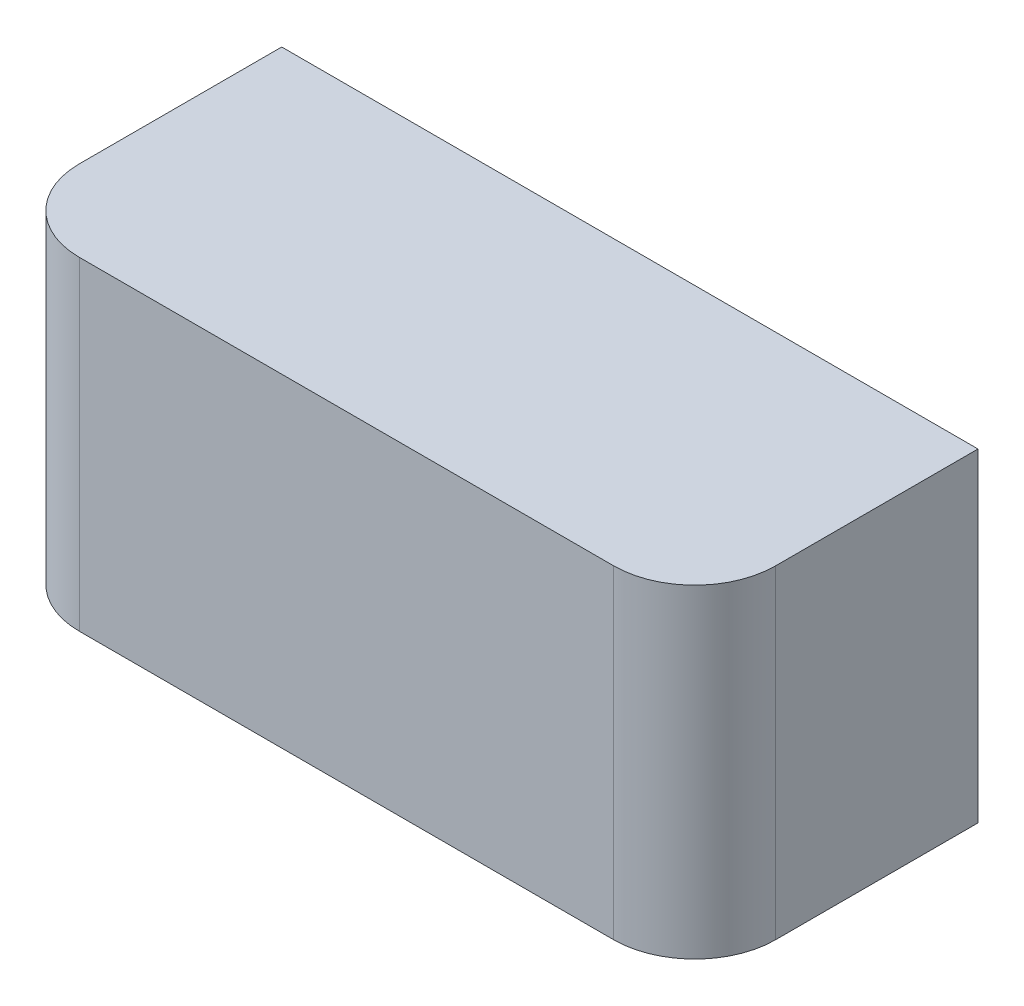
ISO-10303-21;
HEADER;
FILE_DESCRIPTION(('STEP AP214'),'2;1');
FILE_NAME('part.step','',(''),(''),'','','');
FILE_SCHEMA(('AUTOMOTIVE_DESIGN { 1 0 10303 214 1 1 1 1 }'));
ENDSEC;
DATA;
#1=APPLICATION_CONTEXT('core data for automotive mechanical design processes');
#2=APPLICATION_PROTOCOL_DEFINITION('international standard','automotive_design',2000,#1);
#3=PRODUCT_CONTEXT('',#1,'mechanical');
#4=PRODUCT('Part','Part','',(#3));
#5=PRODUCT_RELATED_PRODUCT_CATEGORY('part','',(#4));
#6=PRODUCT_DEFINITION_FORMATION('','',#4);
#7=PRODUCT_DEFINITION_CONTEXT('part definition',#1,'design');
#8=PRODUCT_DEFINITION('design','',#6,#7);
#9=PRODUCT_DEFINITION_SHAPE('','',#8);
#10=(LENGTH_UNIT() NAMED_UNIT(*) SI_UNIT(.MILLI.,.METRE.));
#11=(NAMED_UNIT(*) PLANE_ANGLE_UNIT() SI_UNIT($,.RADIAN.));
#12=(NAMED_UNIT(*) SI_UNIT($,.STERADIAN.) SOLID_ANGLE_UNIT());
#13=UNCERTAINTY_MEASURE_WITH_UNIT(LENGTH_MEASURE(1.E-05),#10,'distance_accuracy_value','');
#14=(GEOMETRIC_REPRESENTATION_CONTEXT(3) GLOBAL_UNCERTAINTY_ASSIGNED_CONTEXT((#13)) GLOBAL_UNIT_ASSIGNED_CONTEXT((#10,
#11,#12)) REPRESENTATION_CONTEXT('',''));
#15=CARTESIAN_POINT('',(0.,0.,0.));
#16=DIRECTION('',(0.,0.,1.));
#17=DIRECTION('',(1.,0.,0.));
#18=AXIS2_PLACEMENT_3D('',#15,#16,#17);
#19=CARTESIAN_POINT('',(2.28,0.,-2.875));
#20=DIRECTION('',(0.,-1.,0.));
#21=DIRECTION('',(0.,0.,-1.));
#22=AXIS2_PLACEMENT_3D('',#19,#20,#21);
#23=CYLINDRICAL_SURFACE('',#22,0.05);
#24=DIRECTION('',(0.,1.,0.));
#25=VECTOR('',#24,1.);
#26=CARTESIAN_POINT('',(2.28,0.,-2.825));
#27=LINE('',#26,#25);
#28=CARTESIAN_POINT('',(2.28,0.2,-2.825));
#29=VERTEX_POINT('',#28);
#30=CARTESIAN_POINT('',(2.28,0.,-2.825));
#31=VERTEX_POINT('',#30);
#32=EDGE_CURVE('E71',#29,#31,#27,.F.);
#33=ORIENTED_EDGE('',*,*,#32,.T.);
#34=CARTESIAN_POINT('',(2.28,0.,-2.875));
#35=DIRECTION('',(0.,-1.,0.));
#36=DIRECTION('',(0.,0.,-1.));
#37=AXIS2_PLACEMENT_3D('',#34,#35,#36);
#38=CIRCLE('',#37,0.05);
#39=CARTESIAN_POINT('',(2.33,0.,-2.875));
#40=VERTEX_POINT('',#39);
#41=EDGE_CURVE('E20',#40,#31,#38,.T.);
#42=ORIENTED_EDGE('',*,*,#41,.F.);
#43=DIRECTION('',(0.,1.,0.));
#44=VECTOR('',#43,1.);
#45=CARTESIAN_POINT('',(2.33,0.,-2.875));
#46=LINE('',#45,#44);
#47=CARTESIAN_POINT('',(2.33,0.2,-2.875));
#48=VERTEX_POINT('',#47);
#49=EDGE_CURVE('E69',#40,#48,#46,.T.);
#50=ORIENTED_EDGE('',*,*,#49,.T.);
#51=CARTESIAN_POINT('',(2.28,0.2,-2.875));
#52=DIRECTION('',(0.,-1.,0.));
#53=DIRECTION('',(0.,0.,-1.));
#54=AXIS2_PLACEMENT_3D('',#51,#52,#53);
#55=CIRCLE('',#54,0.05);
#56=EDGE_CURVE('E101',#48,#29,#55,.T.);
#57=ORIENTED_EDGE('',*,*,#56,.T.);
#58=EDGE_LOOP('',(#33,#42,#50,#57));
#59=FACE_BOUND('',#58,.T.);
#60=ADVANCED_FACE('F17',(#59),#23,.T.);
#61=CARTESIAN_POINT('',(2.28,0.,-2.825));
#62=DIRECTION('',(0.,0.,-1.));
#63=DIRECTION('',(-1.,0.,0.));
#64=AXIS2_PLACEMENT_3D('',#61,#62,#63);
#65=PLANE('',#64);
#66=DIRECTION('',(1.,0.,0.));
#67=VECTOR('',#66,1.);
#68=CARTESIAN_POINT('',(0.,0.2,-2.825));
#69=LINE('',#68,#67);
#70=CARTESIAN_POINT('',(1.95,0.2,-2.825));
#71=VERTEX_POINT('',#70);
#72=EDGE_CURVE('E100',#29,#71,#69,.F.);
#73=ORIENTED_EDGE('',*,*,#72,.T.);
#74=DIRECTION('',(0.,-1.,0.));
#75=VECTOR('',#74,1.);
#76=CARTESIAN_POINT('',(1.95,0.,-2.825));
#77=LINE('',#76,#75);
#78=CARTESIAN_POINT('',(1.95,0.,-2.825));
#79=VERTEX_POINT('',#78);
#80=EDGE_CURVE('E76',#79,#71,#77,.F.);
#81=ORIENTED_EDGE('',*,*,#80,.F.);
#82=DIRECTION('',(1.,0.,0.));
#83=VECTOR('',#82,1.);
#84=CARTESIAN_POINT('',(0.,0.,-2.825));
#85=LINE('',#84,#83);
#86=EDGE_CURVE('E75',#31,#79,#85,.F.);
#87=ORIENTED_EDGE('',*,*,#86,.F.);
#88=ORIENTED_EDGE('',*,*,#32,.F.);
#89=EDGE_LOOP('',(#73,#81,#87,#88));
#90=FACE_BOUND('',#89,.T.);
#91=ADVANCED_FACE('F138',(#90),#65,.F.);
#92=CARTESIAN_POINT('',(1.95,0.,-2.875));
#93=DIRECTION('',(0.,-1.,0.));
#94=DIRECTION('',(0.,0.,-1.));
#95=AXIS2_PLACEMENT_3D('',#92,#93,#94);
#96=CYLINDRICAL_SURFACE('',#95,0.05);
#97=DIRECTION('',(0.,1.,0.));
#98=VECTOR('',#97,1.);
#99=CARTESIAN_POINT('',(1.9,0.,-2.875));
#100=LINE('',#99,#98);
#101=CARTESIAN_POINT('',(1.9,0.2,-2.875));
#102=VERTEX_POINT('',#101);
#103=CARTESIAN_POINT('',(1.9,0.,-2.875));
#104=VERTEX_POINT('',#103);
#105=EDGE_CURVE('E109',#102,#104,#100,.F.);
#106=ORIENTED_EDGE('',*,*,#105,.T.);
#107=CARTESIAN_POINT('',(1.95,0.,-2.875));
#108=DIRECTION('',(0.,-1.,0.));
#109=DIRECTION('',(0.,0.,-1.));
#110=AXIS2_PLACEMENT_3D('',#107,#108,#109);
#111=CIRCLE('',#110,0.05);
#112=EDGE_CURVE('E89',#79,#104,#111,.T.);
#113=ORIENTED_EDGE('',*,*,#112,.F.);
#114=ORIENTED_EDGE('',*,*,#80,.T.);
#115=CARTESIAN_POINT('',(1.95,0.2,-2.875));
#116=DIRECTION('',(0.,-1.,0.));
#117=DIRECTION('',(0.,0.,-1.));
#118=AXIS2_PLACEMENT_3D('',#115,#116,#117);
#119=CIRCLE('',#118,0.05);
#120=EDGE_CURVE('E97',#71,#102,#119,.T.);
#121=ORIENTED_EDGE('',*,*,#120,.T.);
#122=EDGE_LOOP('',(#106,#113,#114,#121));
#123=FACE_BOUND('',#122,.T.);
#124=ADVANCED_FACE('F143',(#123),#96,.T.);
#125=CARTESIAN_POINT('',(0.,0.,0.));
#126=DIRECTION('',(0.,-1.,0.));
#127=DIRECTION('',(0.,0.,-1.));
#128=AXIS2_PLACEMENT_3D('',#125,#126,#127);
#129=PLANE('',#128);
#130=DIRECTION('',(0.,0.,-1.));
#131=VECTOR('',#130,1.);
#132=CARTESIAN_POINT('',(1.9,0.,-2.875));
#133=LINE('',#132,#131);
#134=CARTESIAN_POINT('',(1.9,0.,-3.));
#135=VERTEX_POINT('',#134);
#136=EDGE_CURVE('E99',#104,#135,#133,.T.);
#137=ORIENTED_EDGE('',*,*,#136,.T.);
#138=DIRECTION('',(1.,0.,0.));
#139=VECTOR('',#138,1.);
#140=CARTESIAN_POINT('',(1.9,0.,-3.));
#141=LINE('',#140,#139);
#142=CARTESIAN_POINT('',(2.33,0.,-3.));
#143=VERTEX_POINT('',#142);
#144=EDGE_CURVE('E88',#135,#143,#141,.T.);
#145=ORIENTED_EDGE('',*,*,#144,.T.);
#146=DIRECTION('',(0.,0.,1.));
#147=VECTOR('',#146,1.);
#148=CARTESIAN_POINT('',(2.33,0.,-3.));
#149=LINE('',#148,#147);
#150=EDGE_CURVE('E81',#143,#40,#149,.T.);
#151=ORIENTED_EDGE('',*,*,#150,.T.);
#152=ORIENTED_EDGE('',*,*,#41,.T.);
#153=ORIENTED_EDGE('',*,*,#86,.T.);
#154=ORIENTED_EDGE('',*,*,#112,.T.);
#155=EDGE_LOOP('',(#137,#145,#151,#152,#153,#154));
#156=FACE_BOUND('',#155,.T.);
#157=ADVANCED_FACE('F87',(#156),#129,.T.);
#158=CARTESIAN_POINT('',(2.33,0.,-3.));
#159=DIRECTION('',(-1.,0.,0.));
#160=DIRECTION('',(0.,0.,1.));
#161=AXIS2_PLACEMENT_3D('',#158,#159,#160);
#162=PLANE('',#161);
#163=DIRECTION('',(0.,0.,-1.));
#164=VECTOR('',#163,1.);
#165=CARTESIAN_POINT('',(2.33,0.2,0.));
#166=LINE('',#165,#164);
#167=CARTESIAN_POINT('',(2.33,0.2,-3.));
#168=VERTEX_POINT('',#167);
#169=EDGE_CURVE('E83',#168,#48,#166,.F.);
#170=ORIENTED_EDGE('',*,*,#169,.T.);
#171=ORIENTED_EDGE('',*,*,#49,.F.);
#172=ORIENTED_EDGE('',*,*,#150,.F.);
#173=DIRECTION('',(0.,1.,0.));
#174=VECTOR('',#173,1.);
#175=CARTESIAN_POINT('',(2.33,0.,-3.));
#176=LINE('',#175,#174);
#177=EDGE_CURVE('E119',#143,#168,#176,.T.);
#178=ORIENTED_EDGE('',*,*,#177,.T.);
#179=EDGE_LOOP('',(#170,#171,#172,#178));
#180=FACE_BOUND('',#179,.T.);
#181=ADVANCED_FACE('F79',(#180),#162,.F.);
#182=CARTESIAN_POINT('',(0.,0.2,0.));
#183=DIRECTION('',(0.,-1.,0.));
#184=DIRECTION('',(0.,0.,-1.));
#185=AXIS2_PLACEMENT_3D('',#182,#183,#184);
#186=PLANE('',#185);
#187=ORIENTED_EDGE('',*,*,#120,.F.);
#188=ORIENTED_EDGE('',*,*,#72,.F.);
#189=ORIENTED_EDGE('',*,*,#56,.F.);
#190=ORIENTED_EDGE('',*,*,#169,.F.);
#191=DIRECTION('',(1.,0.,0.));
#192=VECTOR('',#191,1.);
#193=CARTESIAN_POINT('',(1.9,0.2,-3.));
#194=LINE('',#193,#192);
#195=CARTESIAN_POINT('',(1.9,0.2,-3.));
#196=VERTEX_POINT('',#195);
#197=EDGE_CURVE('E26',#168,#196,#194,.F.);
#198=ORIENTED_EDGE('',*,*,#197,.T.);
#199=DIRECTION('',(0.,0.,-1.));
#200=VECTOR('',#199,1.);
#201=CARTESIAN_POINT('',(1.9,0.2,-2.875));
#202=LINE('',#201,#200);
#203=EDGE_CURVE('E34',#196,#102,#202,.F.);
#204=ORIENTED_EDGE('',*,*,#203,.T.);
#205=EDGE_LOOP('',(#187,#188,#189,#190,#198,#204));
#206=FACE_BOUND('',#205,.T.);
#207=ADVANCED_FACE('F134',(#206),#186,.F.);
#208=CARTESIAN_POINT('',(1.9,0.,-2.875));
#209=DIRECTION('',(1.,0.,0.));
#210=DIRECTION('',(0.,0.,-1.));
#211=AXIS2_PLACEMENT_3D('',#208,#209,#210);
#212=PLANE('',#211);
#213=ORIENTED_EDGE('',*,*,#203,.F.);
#214=DIRECTION('',(0.,1.,0.));
#215=VECTOR('',#214,1.);
#216=CARTESIAN_POINT('',(1.9,0.,-3.));
#217=LINE('',#216,#215);
#218=EDGE_CURVE('E11',#196,#135,#217,.F.);
#219=ORIENTED_EDGE('',*,*,#218,.T.);
#220=ORIENTED_EDGE('',*,*,#136,.F.);
#221=ORIENTED_EDGE('',*,*,#105,.F.);
#222=EDGE_LOOP('',(#213,#219,#220,#221));
#223=FACE_BOUND('',#222,.T.);
#224=ADVANCED_FACE('F142',(#223),#212,.F.);
#225=CARTESIAN_POINT('',(1.9,0.,-3.));
#226=DIRECTION('',(0.,0.,1.));
#227=DIRECTION('',(1.,0.,0.));
#228=AXIS2_PLACEMENT_3D('',#225,#226,#227);
#229=PLANE('',#228);
#230=ORIENTED_EDGE('',*,*,#197,.F.);
#231=ORIENTED_EDGE('',*,*,#177,.F.);
#232=ORIENTED_EDGE('',*,*,#144,.F.);
#233=ORIENTED_EDGE('',*,*,#218,.F.);
#234=EDGE_LOOP('',(#230,#231,#232,#233));
#235=FACE_BOUND('',#234,.T.);
#236=ADVANCED_FACE('F131',(#235),#229,.F.);
#237=CLOSED_SHELL('',(#60,#91,#124,#157,#181,#207,#224,#236));
#238=MANIFOLD_SOLID_BREP('B1',#237);
#239=ADVANCED_BREP_SHAPE_REPRESENTATION('',(#18,#238),#14);
#240=SHAPE_DEFINITION_REPRESENTATION(#9,#239);
ENDSEC;
END-ISO-10303-21;
